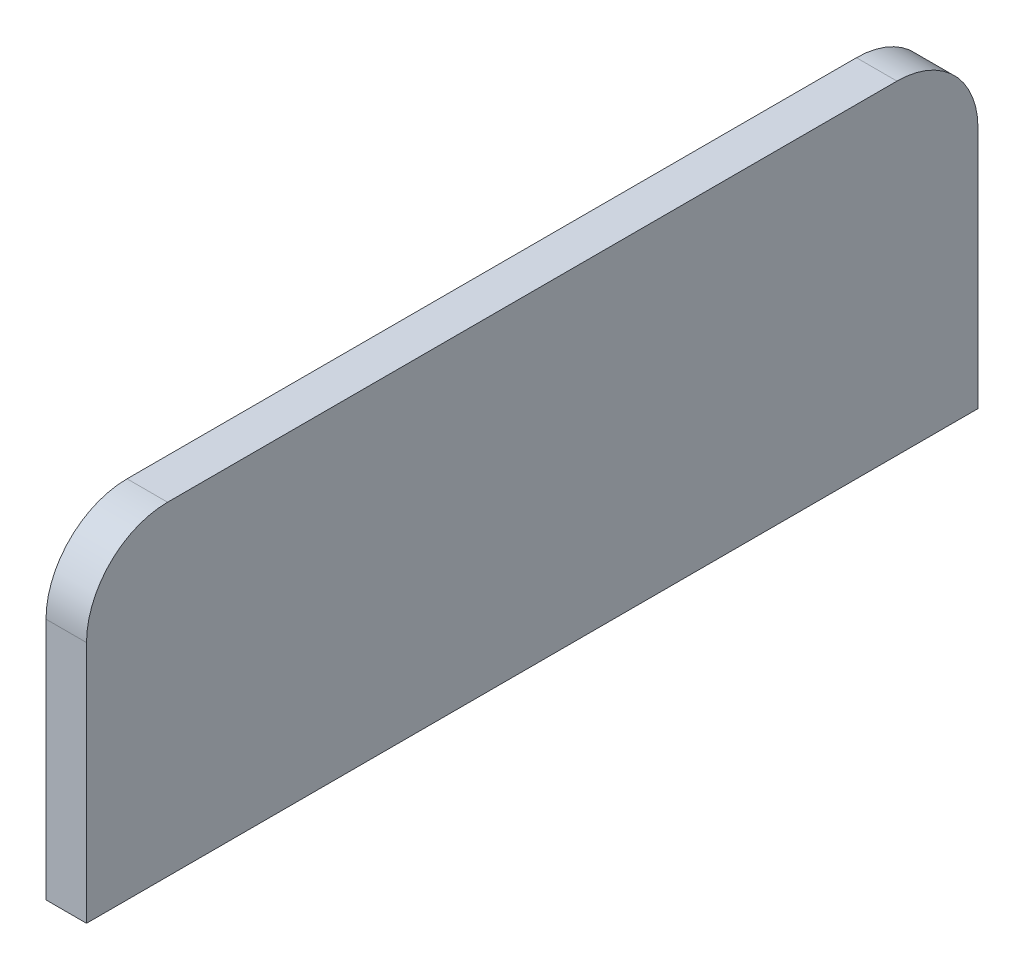
ISO-10303-21;
HEADER;
FILE_DESCRIPTION(('STEP AP214'),'2;1');
FILE_NAME('part.step','',(''),(''),'','','');
FILE_SCHEMA(('AUTOMOTIVE_DESIGN { 1 0 10303 214 1 1 1 1 }'));
ENDSEC;
DATA;
#1=APPLICATION_CONTEXT('core data for automotive mechanical design processes');
#2=APPLICATION_PROTOCOL_DEFINITION('international standard','automotive_design',2000,#1);
#3=PRODUCT_CONTEXT('',#1,'mechanical');
#4=PRODUCT('Part','Part','',(#3));
#5=PRODUCT_RELATED_PRODUCT_CATEGORY('part','',(#4));
#6=PRODUCT_DEFINITION_FORMATION('','',#4);
#7=PRODUCT_DEFINITION_CONTEXT('part definition',#1,'design');
#8=PRODUCT_DEFINITION('design','',#6,#7);
#9=PRODUCT_DEFINITION_SHAPE('','',#8);
#10=(LENGTH_UNIT() NAMED_UNIT(*) SI_UNIT(.MILLI.,.METRE.));
#11=(NAMED_UNIT(*) PLANE_ANGLE_UNIT() SI_UNIT($,.RADIAN.));
#12=(NAMED_UNIT(*) SI_UNIT($,.STERADIAN.) SOLID_ANGLE_UNIT());
#13=UNCERTAINTY_MEASURE_WITH_UNIT(LENGTH_MEASURE(1.E-05),#10,'distance_accuracy_value','');
#14=(GEOMETRIC_REPRESENTATION_CONTEXT(3) GLOBAL_UNCERTAINTY_ASSIGNED_CONTEXT((#13)) GLOBAL_UNIT_ASSIGNED_CONTEXT((#10,
#11,#12)) REPRESENTATION_CONTEXT('',''));
#15=CARTESIAN_POINT('',(0.,0.,0.));
#16=DIRECTION('',(0.,0.,1.));
#17=DIRECTION('',(1.,0.,0.));
#18=AXIS2_PLACEMENT_3D('',#15,#16,#17);
#19=CARTESIAN_POINT('',(3.175,12.7,-34.925));
#20=DIRECTION('',(0.,0.,1.));
#21=DIRECTION('',(0.,-1.,0.));
#22=AXIS2_PLACEMENT_3D('',#19,#20,#21);
#23=PLANE('',#22);
#24=DIRECTION('',(0.,1.,0.));
#25=VECTOR('',#24,1.);
#26=CARTESIAN_POINT('',(0.,12.7,-34.925));
#27=LINE('',#26,#25);
#28=CARTESIAN_POINT('',(0.,-12.7,-34.925));
#29=VERTEX_POINT('',#28);
#30=CARTESIAN_POINT('',(0.,6.35,-34.925));
#31=VERTEX_POINT('',#30);
#32=EDGE_CURVE('E115',#29,#31,#27,.T.);
#33=ORIENTED_EDGE('',*,*,#32,.T.);
#34=DIRECTION('',(-1.,0.,0.));
#35=VECTOR('',#34,1.);
#36=CARTESIAN_POINT('',(3.175,6.35,-34.925));
#37=LINE('',#36,#35);
#38=CARTESIAN_POINT('',(3.175,6.35,-34.925));
#39=VERTEX_POINT('',#38);
#40=EDGE_CURVE('E11',#31,#39,#37,.F.);
#41=ORIENTED_EDGE('',*,*,#40,.T.);
#42=DIRECTION('',(0.,1.,0.));
#43=VECTOR('',#42,1.);
#44=CARTESIAN_POINT('',(3.175,12.7,-34.925));
#45=LINE('',#44,#43);
#46=CARTESIAN_POINT('',(3.175,-12.7,-34.925));
#47=VERTEX_POINT('',#46);
#48=EDGE_CURVE('E121',#47,#39,#45,.T.);
#49=ORIENTED_EDGE('',*,*,#48,.F.);
#50=DIRECTION('',(-1.,0.,0.));
#51=VECTOR('',#50,1.);
#52=CARTESIAN_POINT('',(3.175,-12.7,-34.925));
#53=LINE('',#52,#51);
#54=EDGE_CURVE('E107',#47,#29,#53,.T.);
#55=ORIENTED_EDGE('',*,*,#54,.T.);
#56=EDGE_LOOP('',(#33,#41,#49,#55));
#57=FACE_BOUND('',#56,.T.);
#58=ADVANCED_FACE('F33',(#57),#23,.F.);
#59=CARTESIAN_POINT('',(3.175,12.7,34.925));
#60=DIRECTION('',(0.,-1.,0.));
#61=DIRECTION('',(0.,0.,-1.));
#62=AXIS2_PLACEMENT_3D('',#59,#60,#61);
#63=PLANE('',#62);
#64=DIRECTION('',(0.,0.,1.));
#65=VECTOR('',#64,1.);
#66=CARTESIAN_POINT('',(0.,12.7,34.925));
#67=LINE('',#66,#65);
#68=CARTESIAN_POINT('',(0.,12.7,-28.575));
#69=VERTEX_POINT('',#68);
#70=CARTESIAN_POINT('',(0.,12.7,28.575));
#71=VERTEX_POINT('',#70);
#72=EDGE_CURVE('E117',#69,#71,#67,.T.);
#73=ORIENTED_EDGE('',*,*,#72,.T.);
#74=DIRECTION('',(-1.,0.,0.));
#75=VECTOR('',#74,1.);
#76=CARTESIAN_POINT('',(3.175,12.7,28.575));
#77=LINE('',#76,#75);
#78=CARTESIAN_POINT('',(3.175,12.7,28.575));
#79=VERTEX_POINT('',#78);
#80=EDGE_CURVE('E54',#71,#79,#77,.F.);
#81=ORIENTED_EDGE('',*,*,#80,.T.);
#82=DIRECTION('',(0.,0.,1.));
#83=VECTOR('',#82,1.);
#84=CARTESIAN_POINT('',(3.175,12.7,34.925));
#85=LINE('',#84,#83);
#86=CARTESIAN_POINT('',(3.175,12.7,-28.575));
#87=VERTEX_POINT('',#86);
#88=EDGE_CURVE('E97',#87,#79,#85,.T.);
#89=ORIENTED_EDGE('',*,*,#88,.F.);
#90=DIRECTION('',(-1.,0.,0.));
#91=VECTOR('',#90,1.);
#92=CARTESIAN_POINT('',(3.175,12.7,-28.575));
#93=LINE('',#92,#91);
#94=EDGE_CURVE('E128',#87,#69,#93,.T.);
#95=ORIENTED_EDGE('',*,*,#94,.T.);
#96=EDGE_LOOP('',(#73,#81,#89,#95));
#97=FACE_BOUND('',#96,.T.);
#98=ADVANCED_FACE('F136',(#97),#63,.F.);
#99=CARTESIAN_POINT('',(3.175,12.7,34.925));
#100=DIRECTION('',(0.,0.,-1.));
#101=DIRECTION('',(-1.,0.,0.));
#102=AXIS2_PLACEMENT_3D('',#99,#100,#101);
#103=PLANE('',#102);
#104=DIRECTION('',(0.,-1.,0.));
#105=VECTOR('',#104,1.);
#106=CARTESIAN_POINT('',(3.175,12.7,34.925));
#107=LINE('',#106,#105);
#108=CARTESIAN_POINT('',(3.175,6.35,34.925));
#109=VERTEX_POINT('',#108);
#110=CARTESIAN_POINT('',(3.175,-12.7,34.925));
#111=VERTEX_POINT('',#110);
#112=EDGE_CURVE('E87',#109,#111,#107,.T.);
#113=ORIENTED_EDGE('',*,*,#112,.F.);
#114=DIRECTION('',(-1.,0.,0.));
#115=VECTOR('',#114,1.);
#116=CARTESIAN_POINT('',(3.175,6.35,34.925));
#117=LINE('',#116,#115);
#118=CARTESIAN_POINT('',(0.,6.35,34.925));
#119=VERTEX_POINT('',#118);
#120=EDGE_CURVE('E106',#109,#119,#117,.T.);
#121=ORIENTED_EDGE('',*,*,#120,.T.);
#122=DIRECTION('',(0.,-1.,0.));
#123=VECTOR('',#122,1.);
#124=CARTESIAN_POINT('',(0.,12.7,34.925));
#125=LINE('',#124,#123);
#126=CARTESIAN_POINT('',(0.,-12.7,34.925));
#127=VERTEX_POINT('',#126);
#128=EDGE_CURVE('E103',#119,#127,#125,.T.);
#129=ORIENTED_EDGE('',*,*,#128,.T.);
#130=DIRECTION('',(-1.,0.,0.));
#131=VECTOR('',#130,1.);
#132=CARTESIAN_POINT('',(3.175,-12.7,34.925));
#133=LINE('',#132,#131);
#134=EDGE_CURVE('E100',#111,#127,#133,.T.);
#135=ORIENTED_EDGE('',*,*,#134,.F.);
#136=EDGE_LOOP('',(#113,#121,#129,#135));
#137=FACE_BOUND('',#136,.T.);
#138=ADVANCED_FACE('F101',(#137),#103,.F.);
#139=CARTESIAN_POINT('',(3.175,-12.7,34.925));
#140=DIRECTION('',(0.,1.,0.));
#141=DIRECTION('',(0.,0.,1.));
#142=AXIS2_PLACEMENT_3D('',#139,#140,#141);
#143=PLANE('',#142);
#144=DIRECTION('',(0.,0.,-1.));
#145=VECTOR('',#144,1.);
#146=CARTESIAN_POINT('',(0.,-12.7,34.925));
#147=LINE('',#146,#145);
#148=EDGE_CURVE('E120',#127,#29,#147,.T.);
#149=ORIENTED_EDGE('',*,*,#148,.T.);
#150=ORIENTED_EDGE('',*,*,#54,.F.);
#151=DIRECTION('',(0.,0.,-1.));
#152=VECTOR('',#151,1.);
#153=CARTESIAN_POINT('',(3.175,-12.7,34.925));
#154=LINE('',#153,#152);
#155=EDGE_CURVE('E91',#111,#47,#154,.T.);
#156=ORIENTED_EDGE('',*,*,#155,.F.);
#157=ORIENTED_EDGE('',*,*,#134,.T.);
#158=EDGE_LOOP('',(#149,#150,#156,#157));
#159=FACE_BOUND('',#158,.T.);
#160=ADVANCED_FACE('F109',(#159),#143,.F.);
#161=CARTESIAN_POINT('',(3.175,0.,0.));
#162=DIRECTION('',(1.,0.,0.));
#163=DIRECTION('',(0.,0.,-1.));
#164=AXIS2_PLACEMENT_3D('',#161,#162,#163);
#165=PLANE('',#164);
#166=ORIENTED_EDGE('',*,*,#88,.T.);
#167=CARTESIAN_POINT('',(3.175,6.35,28.575));
#168=DIRECTION('',(1.,0.,0.));
#169=DIRECTION('',(0.,0.,-1.));
#170=AXIS2_PLACEMENT_3D('',#167,#168,#169);
#171=CIRCLE('',#170,6.35);
#172=EDGE_CURVE('E41',#79,#109,#171,.T.);
#173=ORIENTED_EDGE('',*,*,#172,.T.);
#174=ORIENTED_EDGE('',*,*,#112,.T.);
#175=ORIENTED_EDGE('',*,*,#155,.T.);
#176=ORIENTED_EDGE('',*,*,#48,.T.);
#177=CARTESIAN_POINT('',(3.175,6.35,-28.575));
#178=DIRECTION('',(1.,0.,0.));
#179=DIRECTION('',(0.,0.,-1.));
#180=AXIS2_PLACEMENT_3D('',#177,#178,#179);
#181=CIRCLE('',#180,6.35);
#182=EDGE_CURVE('E132',#39,#87,#181,.T.);
#183=ORIENTED_EDGE('',*,*,#182,.T.);
#184=EDGE_LOOP('',(#166,#173,#174,#175,#176,#183));
#185=FACE_BOUND('',#184,.T.);
#186=ADVANCED_FACE('F89',(#185),#165,.T.);
#187=CARTESIAN_POINT('',(0.,0.,0.));
#188=DIRECTION('',(1.,0.,0.));
#189=DIRECTION('',(0.,0.,-1.));
#190=AXIS2_PLACEMENT_3D('',#187,#188,#189);
#191=PLANE('',#190);
#192=ORIENTED_EDGE('',*,*,#128,.F.);
#193=CARTESIAN_POINT('',(0.,6.35,28.575));
#194=DIRECTION('',(1.,0.,0.));
#195=DIRECTION('',(0.,0.,-1.));
#196=AXIS2_PLACEMENT_3D('',#193,#194,#195);
#197=CIRCLE('',#196,6.35);
#198=EDGE_CURVE('E126',#119,#71,#197,.F.);
#199=ORIENTED_EDGE('',*,*,#198,.T.);
#200=ORIENTED_EDGE('',*,*,#72,.F.);
#201=CARTESIAN_POINT('',(0.,6.35,-28.575));
#202=DIRECTION('',(1.,0.,0.));
#203=DIRECTION('',(0.,0.,-1.));
#204=AXIS2_PLACEMENT_3D('',#201,#202,#203);
#205=CIRCLE('',#204,6.35);
#206=EDGE_CURVE('E124',#69,#31,#205,.F.);
#207=ORIENTED_EDGE('',*,*,#206,.T.);
#208=ORIENTED_EDGE('',*,*,#32,.F.);
#209=ORIENTED_EDGE('',*,*,#148,.F.);
#210=EDGE_LOOP('',(#192,#199,#200,#207,#208,#209));
#211=FACE_BOUND('',#210,.T.);
#212=ADVANCED_FACE('F140',(#211),#191,.F.);
#213=CARTESIAN_POINT('',(3.175,6.35,28.575));
#214=DIRECTION('',(-1.,0.,0.));
#215=DIRECTION('',(0.,0.,1.));
#216=AXIS2_PLACEMENT_3D('',#213,#214,#215);
#217=CYLINDRICAL_SURFACE('',#216,6.35);
#218=ORIENTED_EDGE('',*,*,#172,.F.);
#219=ORIENTED_EDGE('',*,*,#80,.F.);
#220=ORIENTED_EDGE('',*,*,#198,.F.);
#221=ORIENTED_EDGE('',*,*,#120,.F.);
#222=EDGE_LOOP('',(#218,#219,#220,#221));
#223=FACE_BOUND('',#222,.T.);
#224=ADVANCED_FACE('F149',(#223),#217,.T.);
#225=CARTESIAN_POINT('',(3.175,6.35,-28.575));
#226=DIRECTION('',(-1.,0.,0.));
#227=DIRECTION('',(0.,0.,1.));
#228=AXIS2_PLACEMENT_3D('',#225,#226,#227);
#229=CYLINDRICAL_SURFACE('',#228,6.35);
#230=ORIENTED_EDGE('',*,*,#182,.F.);
#231=ORIENTED_EDGE('',*,*,#40,.F.);
#232=ORIENTED_EDGE('',*,*,#206,.F.);
#233=ORIENTED_EDGE('',*,*,#94,.F.);
#234=EDGE_LOOP('',(#230,#231,#232,#233));
#235=FACE_BOUND('',#234,.T.);
#236=ADVANCED_FACE('F35',(#235),#229,.T.);
#237=CLOSED_SHELL('',(#58,#98,#138,#160,#186,#212,#224,#236));
#238=MANIFOLD_SOLID_BREP('B2',#237);
#239=ADVANCED_BREP_SHAPE_REPRESENTATION('',(#18,#238),#14);
#240=SHAPE_DEFINITION_REPRESENTATION(#9,#239);
ENDSEC;
END-ISO-10303-21;
